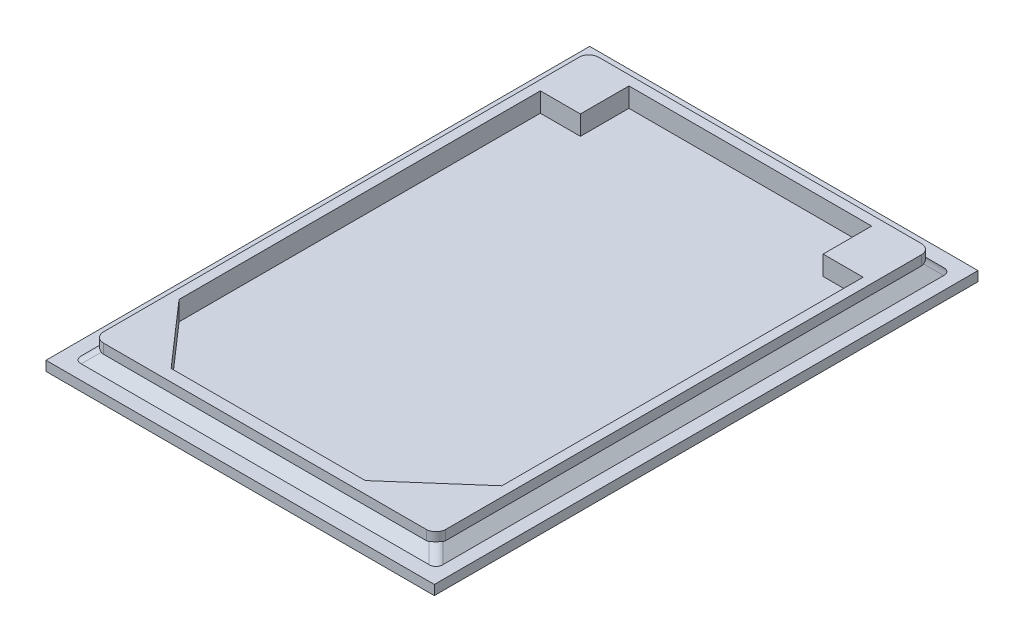
ISO-10303-21;
HEADER;
FILE_DESCRIPTION(('STEP AP214'),'2;1');
FILE_NAME('part.step','',(''),(''),'','','');
FILE_SCHEMA(('AUTOMOTIVE_DESIGN { 1 0 10303 214 1 1 1 1 }'));
ENDSEC;
DATA;
#1=APPLICATION_CONTEXT('core data for automotive mechanical design processes');
#2=APPLICATION_PROTOCOL_DEFINITION('international standard','automotive_design',2000,#1);
#3=PRODUCT_CONTEXT('',#1,'mechanical');
#4=PRODUCT('Part','Part','',(#3));
#5=PRODUCT_RELATED_PRODUCT_CATEGORY('part','',(#4));
#6=PRODUCT_DEFINITION_FORMATION('','',#4);
#7=PRODUCT_DEFINITION_CONTEXT('part definition',#1,'design');
#8=PRODUCT_DEFINITION('design','',#6,#7);
#9=PRODUCT_DEFINITION_SHAPE('','',#8);
#10=(LENGTH_UNIT() NAMED_UNIT(*) SI_UNIT(.MILLI.,.METRE.));
#11=(NAMED_UNIT(*) PLANE_ANGLE_UNIT() SI_UNIT($,.RADIAN.));
#12=(NAMED_UNIT(*) SI_UNIT($,.STERADIAN.) SOLID_ANGLE_UNIT());
#13=UNCERTAINTY_MEASURE_WITH_UNIT(LENGTH_MEASURE(1.E-05),#10,'distance_accuracy_value','');
#14=(GEOMETRIC_REPRESENTATION_CONTEXT(3) GLOBAL_UNCERTAINTY_ASSIGNED_CONTEXT((#13)) GLOBAL_UNIT_ASSIGNED_CONTEXT((#10,
#11,#12)) REPRESENTATION_CONTEXT('',''));
#15=CARTESIAN_POINT('',(0.,0.,0.));
#16=DIRECTION('',(0.,0.,1.));
#17=DIRECTION('',(1.,0.,0.));
#18=AXIS2_PLACEMENT_3D('',#15,#16,#17);
#19=CARTESIAN_POINT('',(0.,1.,0.));
#20=DIRECTION('',(0.,1.,0.));
#21=DIRECTION('',(0.,0.,1.));
#22=AXIS2_PLACEMENT_3D('',#19,#20,#21);
#23=PLANE('',#22);
#24=DIRECTION('',(0.,0.,1.));
#25=VECTOR('',#24,1.);
#26=CARTESIAN_POINT('',(23.6383511724123,1.,0.));
#27=LINE('',#26,#25);
#28=CARTESIAN_POINT('',(23.6383511724123,1.,-12.4881060797479));
#29=VERTEX_POINT('',#28);
#30=CARTESIAN_POINT('',(23.6383511724123,1.,39.097680357879));
#31=VERTEX_POINT('',#30);
#32=EDGE_CURVE('E370',#29,#31,#27,.T.);
#33=ORIENTED_EDGE('',*,*,#32,.T.);
#34=CARTESIAN_POINT('',(22.2241376100392,0.999999999999999,38.3905735766925));
#35=DIRECTION('',(0.,1.,0.));
#36=DIRECTION('',(-0.707106781186548,0.,-0.707106781186548));
#37=AXIS2_PLACEMENT_3D('',#34,#35,#36);
#38=ELLIPSE('',#37,1.73205080756886,1.);
#39=CARTESIAN_POINT('',(22.9312443912257,1.,39.8047871390655));
#40=VERTEX_POINT('',#39);
#41=EDGE_CURVE('E442',#31,#40,#38,.F.);
#42=ORIENTED_EDGE('',*,*,#41,.T.);
#43=DIRECTION('',(-1.,0.,0.));
#44=VECTOR('',#43,1.);
#45=CARTESIAN_POINT('',(0.,1.,39.8047871390655));
#46=LINE('',#45,#44);
#47=CARTESIAN_POINT('',(-12.9045420464012,1.,39.8047871390655));
#48=VERTEX_POINT('',#47);
#49=EDGE_CURVE('E367',#40,#48,#46,.T.);
#50=ORIENTED_EDGE('',*,*,#49,.T.);
#51=CARTESIAN_POINT('',(-12.1974352652146,1.,38.3905735766925));
#52=DIRECTION('',(0.,1.,0.));
#53=DIRECTION('',(0.707106781186548,0.,-0.707106781186547));
#54=AXIS2_PLACEMENT_3D('',#51,#52,#53);
#55=ELLIPSE('',#54,1.73205080756886,1.);
#56=CARTESIAN_POINT('',(-13.6116488275877,1.,39.097680357879));
#57=VERTEX_POINT('',#56);
#58=EDGE_CURVE('E449',#48,#57,#55,.F.);
#59=ORIENTED_EDGE('',*,*,#58,.T.);
#60=DIRECTION('',(0.,0.,-1.));
#61=VECTOR('',#60,1.);
#62=CARTESIAN_POINT('',(-13.6116488275877,1.,0.));
#63=LINE('',#62,#61);
#64=CARTESIAN_POINT('',(-13.6116488275877,1.,-12.4881060797479));
#65=VERTEX_POINT('',#64);
#66=EDGE_CURVE('E376',#57,#65,#63,.T.);
#67=ORIENTED_EDGE('',*,*,#66,.T.);
#68=CARTESIAN_POINT('',(-12.1974352652146,1.,-11.7809992985614));
#69=DIRECTION('',(0.,1.,0.));
#70=DIRECTION('',(-0.707106781186548,0.,-0.707106781186547));
#71=AXIS2_PLACEMENT_3D('',#68,#69,#70);
#72=ELLIPSE('',#71,1.73205080756886,1.);
#73=CARTESIAN_POINT('',(-12.9045420464012,1.,-13.1952128609345));
#74=VERTEX_POINT('',#73);
#75=EDGE_CURVE('E428',#65,#74,#72,.F.);
#76=ORIENTED_EDGE('',*,*,#75,.T.);
#77=DIRECTION('',(1.,0.,0.));
#78=VECTOR('',#77,1.);
#79=CARTESIAN_POINT('',(0.,1.,-13.1952128609345));
#80=LINE('',#79,#78);
#81=CARTESIAN_POINT('',(22.9312443912257,1.,-13.1952128609345));
#82=VERTEX_POINT('',#81);
#83=EDGE_CURVE('E373',#74,#82,#80,.T.);
#84=ORIENTED_EDGE('',*,*,#83,.T.);
#85=CARTESIAN_POINT('',(22.2241376100392,0.999999999999999,-11.7809992985614));
#86=DIRECTION('',(0.,1.,0.));
#87=DIRECTION('',(0.707106781186548,0.,-0.707106781186548));
#88=AXIS2_PLACEMENT_3D('',#85,#86,#87);
#89=ELLIPSE('',#88,1.73205080756886,1.);
#90=EDGE_CURVE('E435',#82,#29,#89,.F.);
#91=ORIENTED_EDGE('',*,*,#90,.T.);
#92=EDGE_LOOP('',(#33,#42,#50,#59,#67,#76,#84,#91));
#93=FACE_BOUND('',#92,.T.);
#94=DIRECTION('',(0.,0.,1.));
#95=VECTOR('',#94,1.);
#96=CARTESIAN_POINT('',(-15.0390033373364,1.,-14.7020848411484));
#97=LINE('',#96,#95);
#98=CARTESIAN_POINT('',(-15.0390033373364,1.,-14.7020848411484));
#99=VERTEX_POINT('',#98);
#100=CARTESIAN_POINT('',(-15.0390033373364,1.,41.2979151588516));
#101=VERTEX_POINT('',#100);
#102=EDGE_CURVE('E335',#99,#101,#97,.T.);
#103=ORIENTED_EDGE('',*,*,#102,.T.);
#104=DIRECTION('',(1.,0.,0.));
#105=VECTOR('',#104,1.);
#106=CARTESIAN_POINT('',(-15.0390033373364,1.,41.2979151588516));
#107=LINE('',#106,#105);
#108=CARTESIAN_POINT('',(24.9609966626636,1.,41.2979151588516));
#109=VERTEX_POINT('',#108);
#110=EDGE_CURVE('E338',#101,#109,#107,.T.);
#111=ORIENTED_EDGE('',*,*,#110,.T.);
#112=DIRECTION('',(0.,0.,-1.));
#113=VECTOR('',#112,1.);
#114=CARTESIAN_POINT('',(24.9609966626636,1.,-14.7020848411484));
#115=LINE('',#114,#113);
#116=CARTESIAN_POINT('',(24.9609966626636,1.,-14.7020848411484));
#117=VERTEX_POINT('',#116);
#118=EDGE_CURVE('E341',#109,#117,#115,.T.);
#119=ORIENTED_EDGE('',*,*,#118,.T.);
#120=DIRECTION('',(-1.,0.,0.));
#121=VECTOR('',#120,1.);
#122=CARTESIAN_POINT('',(-15.0390033373364,1.,-14.7020848411484));
#123=LINE('',#122,#121);
#124=EDGE_CURVE('E343',#117,#99,#123,.T.);
#125=ORIENTED_EDGE('',*,*,#124,.T.);
#126=EDGE_LOOP('',(#103,#111,#119,#125));
#127=FACE_BOUND('',#126,.T.);
#128=ADVANCED_FACE('F36',(#93,#127),#23,.T.);
#129=CARTESIAN_POINT('',(-15.0390033373364,1.,-14.7020848411484));
#130=DIRECTION('',(1.,0.,0.));
#131=DIRECTION('',(0.,0.,-1.));
#132=AXIS2_PLACEMENT_3D('',#129,#130,#131);
#133=PLANE('',#132);
#134=DIRECTION('',(0.,0.,1.));
#135=VECTOR('',#134,1.);
#136=CARTESIAN_POINT('',(-15.0390033373364,0.,-14.7020848411484));
#137=LINE('',#136,#135);
#138=CARTESIAN_POINT('',(-15.0390033373364,0.,-14.7020848411484));
#139=VERTEX_POINT('',#138);
#140=CARTESIAN_POINT('',(-15.0390033373364,0.,41.2979151588516));
#141=VERTEX_POINT('',#140);
#142=EDGE_CURVE('E334',#139,#141,#137,.T.);
#143=ORIENTED_EDGE('',*,*,#142,.T.);
#144=DIRECTION('',(0.,-1.,0.));
#145=VECTOR('',#144,1.);
#146=CARTESIAN_POINT('',(-15.0390033373364,1.,41.2979151588516));
#147=LINE('',#146,#145);
#148=EDGE_CURVE('E361',#101,#141,#147,.T.);
#149=ORIENTED_EDGE('',*,*,#148,.F.);
#150=ORIENTED_EDGE('',*,*,#102,.F.);
#151=DIRECTION('',(0.,-1.,0.));
#152=VECTOR('',#151,1.);
#153=CARTESIAN_POINT('',(-15.0390033373364,1.,-14.7020848411484));
#154=LINE('',#153,#152);
#155=EDGE_CURVE('E345',#99,#139,#154,.T.);
#156=ORIENTED_EDGE('',*,*,#155,.T.);
#157=EDGE_LOOP('',(#143,#149,#150,#156));
#158=FACE_BOUND('',#157,.T.);
#159=ADVANCED_FACE('F535',(#158),#133,.F.);
#160=CARTESIAN_POINT('',(-15.0390033373364,1.,41.2979151588516));
#161=DIRECTION('',(0.,0.,-1.));
#162=DIRECTION('',(-1.,0.,0.));
#163=AXIS2_PLACEMENT_3D('',#160,#161,#162);
#164=PLANE('',#163);
#165=DIRECTION('',(1.,0.,0.));
#166=VECTOR('',#165,1.);
#167=CARTESIAN_POINT('',(-15.0390033373364,0.,41.2979151588516));
#168=LINE('',#167,#166);
#169=CARTESIAN_POINT('',(24.9609966626636,0.,41.2979151588516));
#170=VERTEX_POINT('',#169);
#171=EDGE_CURVE('E348',#141,#170,#168,.T.);
#172=ORIENTED_EDGE('',*,*,#171,.T.);
#173=DIRECTION('',(0.,-1.,0.));
#174=VECTOR('',#173,1.);
#175=CARTESIAN_POINT('',(24.9609966626636,1.,41.2979151588516));
#176=LINE('',#175,#174);
#177=EDGE_CURVE('E358',#109,#170,#176,.T.);
#178=ORIENTED_EDGE('',*,*,#177,.F.);
#179=ORIENTED_EDGE('',*,*,#110,.F.);
#180=ORIENTED_EDGE('',*,*,#148,.T.);
#181=EDGE_LOOP('',(#172,#178,#179,#180));
#182=FACE_BOUND('',#181,.T.);
#183=ADVANCED_FACE('F541',(#182),#164,.F.);
#184=CARTESIAN_POINT('',(24.9609966626636,1.,-14.7020848411484));
#185=DIRECTION('',(-1.,0.,0.));
#186=DIRECTION('',(0.,0.,1.));
#187=AXIS2_PLACEMENT_3D('',#184,#185,#186);
#188=PLANE('',#187);
#189=DIRECTION('',(0.,0.,-1.));
#190=VECTOR('',#189,1.);
#191=CARTESIAN_POINT('',(24.9609966626636,0.,-14.7020848411484));
#192=LINE('',#191,#190);
#193=CARTESIAN_POINT('',(24.9609966626636,0.,-14.7020848411484));
#194=VERTEX_POINT('',#193);
#195=EDGE_CURVE('E350',#170,#194,#192,.T.);
#196=ORIENTED_EDGE('',*,*,#195,.T.);
#197=DIRECTION('',(0.,-1.,0.));
#198=VECTOR('',#197,1.);
#199=CARTESIAN_POINT('',(24.9609966626636,1.,-14.7020848411484));
#200=LINE('',#199,#198);
#201=EDGE_CURVE('E355',#117,#194,#200,.T.);
#202=ORIENTED_EDGE('',*,*,#201,.F.);
#203=ORIENTED_EDGE('',*,*,#118,.F.);
#204=ORIENTED_EDGE('',*,*,#177,.T.);
#205=EDGE_LOOP('',(#196,#202,#203,#204));
#206=FACE_BOUND('',#205,.T.);
#207=ADVANCED_FACE('F733',(#206),#188,.F.);
#208=CARTESIAN_POINT('',(-15.0390033373364,1.,-14.7020848411484));
#209=DIRECTION('',(0.,0.,1.));
#210=DIRECTION('',(1.,0.,0.));
#211=AXIS2_PLACEMENT_3D('',#208,#209,#210);
#212=PLANE('',#211);
#213=DIRECTION('',(-1.,0.,0.));
#214=VECTOR('',#213,1.);
#215=CARTESIAN_POINT('',(-15.0390033373364,0.,-14.7020848411484));
#216=LINE('',#215,#214);
#217=EDGE_CURVE('E339',#194,#139,#216,.T.);
#218=ORIENTED_EDGE('',*,*,#217,.T.);
#219=ORIENTED_EDGE('',*,*,#155,.F.);
#220=ORIENTED_EDGE('',*,*,#124,.F.);
#221=ORIENTED_EDGE('',*,*,#201,.T.);
#222=EDGE_LOOP('',(#218,#219,#220,#221));
#223=FACE_BOUND('',#222,.T.);
#224=ADVANCED_FACE('F725',(#223),#212,.F.);
#225=CARTESIAN_POINT('',(0.,0.,0.));
#226=DIRECTION('',(0.,1.,0.));
#227=DIRECTION('',(0.,0.,1.));
#228=AXIS2_PLACEMENT_3D('',#225,#226,#227);
#229=PLANE('',#228);
#230=ORIENTED_EDGE('',*,*,#142,.F.);
#231=ORIENTED_EDGE('',*,*,#217,.F.);
#232=ORIENTED_EDGE('',*,*,#195,.F.);
#233=ORIENTED_EDGE('',*,*,#171,.F.);
#234=EDGE_LOOP('',(#230,#231,#232,#233));
#235=FACE_BOUND('',#234,.T.);
#236=ADVANCED_FACE('F603',(#235),#229,.F.);
#237=CARTESIAN_POINT('',(0.,3.,0.));
#238=DIRECTION('',(0.,1.,0.));
#239=DIRECTION('',(0.,0.,1.));
#240=AXIS2_PLACEMENT_3D('',#237,#238,#239);
#241=PLANE('',#240);
#242=DIRECTION('',(-1.,0.,0.));
#243=VECTOR('',#242,1.);
#244=CARTESIAN_POINT('',(-12.6116488275877,3.,-12.1952128609345));
#245=LINE('',#244,#243);
#246=CARTESIAN_POINT('',(21.6383511724123,3.,-12.1952128609345));
#247=VERTEX_POINT('',#246);
#248=CARTESIAN_POINT('',(-11.6116488275877,3.,-12.1952128609345));
#249=VERTEX_POINT('',#248);
#250=EDGE_CURVE('E331',#247,#249,#245,.T.);
#251=ORIENTED_EDGE('',*,*,#250,.T.);
#252=CARTESIAN_POINT('',(-11.6116488275877,3.,-11.1952128609345));
#253=DIRECTION('',(0.,1.,0.));
#254=DIRECTION('',(0.,0.,1.));
#255=AXIS2_PLACEMENT_3D('',#252,#253,#254);
#256=CIRCLE('',#255,1.);
#257=CARTESIAN_POINT('',(-12.6116488275877,3.,-11.1952128609345));
#258=VERTEX_POINT('',#257);
#259=EDGE_CURVE('E411',#249,#258,#256,.T.);
#260=ORIENTED_EDGE('',*,*,#259,.T.);
#261=DIRECTION('',(0.,0.,1.));
#262=VECTOR('',#261,1.);
#263=CARTESIAN_POINT('',(-12.6116488275877,3.,-12.1952128609345));
#264=LINE('',#263,#262);
#265=CARTESIAN_POINT('',(-12.6116488275877,3.,37.8047871390655));
#266=VERTEX_POINT('',#265);
#267=EDGE_CURVE('E256',#258,#266,#264,.T.);
#268=ORIENTED_EDGE('',*,*,#267,.T.);
#269=CARTESIAN_POINT('',(-11.6116488275877,3.,37.8047871390655));
#270=DIRECTION('',(0.,1.,0.));
#271=DIRECTION('',(0.,0.,1.));
#272=AXIS2_PLACEMENT_3D('',#269,#270,#271);
#273=CIRCLE('',#272,1.);
#274=CARTESIAN_POINT('',(-11.6116488275877,3.,38.8047871390655));
#275=VERTEX_POINT('',#274);
#276=EDGE_CURVE('E405',#266,#275,#273,.T.);
#277=ORIENTED_EDGE('',*,*,#276,.T.);
#278=DIRECTION('',(1.,0.,0.));
#279=VECTOR('',#278,1.);
#280=CARTESIAN_POINT('',(-12.6116488275877,3.,38.8047871390655));
#281=LINE('',#280,#279);
#282=CARTESIAN_POINT('',(21.6383511724123,3.,38.8047871390655));
#283=VERTEX_POINT('',#282);
#284=EDGE_CURVE('E325',#275,#283,#281,.T.);
#285=ORIENTED_EDGE('',*,*,#284,.T.);
#286=CARTESIAN_POINT('',(21.6383511724123,3.,37.8047871390655));
#287=DIRECTION('',(0.,1.,0.));
#288=DIRECTION('',(0.,0.,1.));
#289=AXIS2_PLACEMENT_3D('',#286,#287,#288);
#290=CIRCLE('',#289,1.);
#291=CARTESIAN_POINT('',(22.6383511724123,3.,37.8047871390655));
#292=VERTEX_POINT('',#291);
#293=EDGE_CURVE('E407',#283,#292,#290,.T.);
#294=ORIENTED_EDGE('',*,*,#293,.T.);
#295=DIRECTION('',(0.,0.,-1.));
#296=VECTOR('',#295,1.);
#297=CARTESIAN_POINT('',(22.6383511724123,3.,-12.1952128609345));
#298=LINE('',#297,#296);
#299=CARTESIAN_POINT('',(22.6383511724123,3.,-11.1952128609345));
#300=VERTEX_POINT('',#299);
#301=EDGE_CURVE('E328',#292,#300,#298,.T.);
#302=ORIENTED_EDGE('',*,*,#301,.T.);
#303=CARTESIAN_POINT('',(21.6383511724123,3.,-11.1952128609345));
#304=DIRECTION('',(0.,1.,0.));
#305=DIRECTION('',(0.,0.,1.));
#306=AXIS2_PLACEMENT_3D('',#303,#304,#305);
#307=CIRCLE('',#306,1.);
#308=EDGE_CURVE('E409',#300,#247,#307,.T.);
#309=ORIENTED_EDGE('',*,*,#308,.T.);
#310=EDGE_LOOP('',(#251,#260,#268,#277,#285,#294,#302,#309));
#311=FACE_BOUND('',#310,.T.);
#312=DIRECTION('',(-1.,0.,0.));
#313=VECTOR('',#312,1.);
#314=CARTESIAN_POINT('',(-11.6116488275877,3.,-6.19521286093445));
#315=LINE('',#314,#313);
#316=CARTESIAN_POINT('',(-7.48664882758773,3.,-6.19521286093446));
#317=VERTEX_POINT('',#316);
#318=CARTESIAN_POINT('',(-11.6116488275877,3.,-6.19521286093445));
#319=VERTEX_POINT('',#318);
#320=EDGE_CURVE('E247',#317,#319,#315,.T.);
#321=ORIENTED_EDGE('',*,*,#320,.F.);
#322=DIRECTION('',(0.,0.,1.));
#323=VECTOR('',#322,1.);
#324=CARTESIAN_POINT('',(-7.48664882758773,3.,-6.19521286093446));
#325=LINE('',#324,#323);
#326=CARTESIAN_POINT('',(-7.48664882758773,3.,-11.1952128609344));
#327=VERTEX_POINT('',#326);
#328=EDGE_CURVE('E237',#327,#317,#325,.T.);
#329=ORIENTED_EDGE('',*,*,#328,.F.);
#330=DIRECTION('',(-1.,0.,0.));
#331=VECTOR('',#330,1.);
#332=CARTESIAN_POINT('',(-7.48664882758773,3.,-11.1952128609344));
#333=LINE('',#332,#331);
#334=CARTESIAN_POINT('',(17.5133511724123,3.,-11.1952128609345));
#335=VERTEX_POINT('',#334);
#336=EDGE_CURVE('E279',#335,#327,#333,.T.);
#337=ORIENTED_EDGE('',*,*,#336,.F.);
#338=DIRECTION('',(0.,0.,-1.));
#339=VECTOR('',#338,1.);
#340=CARTESIAN_POINT('',(17.5133511724123,3.,-11.1952128609345));
#341=LINE('',#340,#339);
#342=CARTESIAN_POINT('',(17.5133511724123,3.,-6.19521286093445));
#343=VERTEX_POINT('',#342);
#344=EDGE_CURVE('E276',#343,#335,#341,.T.);
#345=ORIENTED_EDGE('',*,*,#344,.F.);
#346=DIRECTION('',(-1.,0.,0.));
#347=VECTOR('',#346,1.);
#348=CARTESIAN_POINT('',(17.5133511724123,3.,-6.19521286093445));
#349=LINE('',#348,#347);
#350=CARTESIAN_POINT('',(21.6383511724123,3.,-6.19521286093445));
#351=VERTEX_POINT('',#350);
#352=EDGE_CURVE('E274',#351,#343,#349,.T.);
#353=ORIENTED_EDGE('',*,*,#352,.F.);
#354=DIRECTION('',(0.,0.,-1.));
#355=VECTOR('',#354,1.);
#356=CARTESIAN_POINT('',(21.6383511724123,3.,-6.19521286093445));
#357=LINE('',#356,#355);
#358=CARTESIAN_POINT('',(21.6383511724123,3.,31.0197871390655));
#359=VERTEX_POINT('',#358);
#360=EDGE_CURVE('E272',#359,#351,#357,.T.);
#361=ORIENTED_EDGE('',*,*,#360,.F.);
#362=DIRECTION('',(0.752354793863279,0.,-0.658758122645135));
#363=VECTOR('',#362,1.);
#364=CARTESIAN_POINT('',(21.6383511724123,3.,31.0197871390655));
#365=LINE('',#364,#363);
#366=CARTESIAN_POINT('',(14.1383511724123,3.,37.5867499073474));
#367=VERTEX_POINT('',#366);
#368=EDGE_CURVE('E270',#367,#359,#365,.T.);
#369=ORIENTED_EDGE('',*,*,#368,.F.);
#370=DIRECTION('',(1.,0.,0.));
#371=VECTOR('',#370,1.);
#372=CARTESIAN_POINT('',(14.1383511724123,3.,37.5867499073474));
#373=LINE('',#372,#371);
#374=CARTESIAN_POINT('',(-5.86164882758774,3.,37.5867499073474));
#375=VERTEX_POINT('',#374);
#376=EDGE_CURVE('E268',#375,#367,#373,.T.);
#377=ORIENTED_EDGE('',*,*,#376,.F.);
#378=DIRECTION('',(0.658758122645136,0.,0.752354793863279));
#379=VECTOR('',#378,1.);
#380=CARTESIAN_POINT('',(-5.86164882758774,3.,37.5867499073474));
#381=LINE('',#380,#379);
#382=CARTESIAN_POINT('',(-11.6116488275877,3.,31.0197871390656));
#383=VERTEX_POINT('',#382);
#384=EDGE_CURVE('E264',#383,#375,#381,.T.);
#385=ORIENTED_EDGE('',*,*,#384,.F.);
#386=DIRECTION('',(0.,0.,1.));
#387=VECTOR('',#386,1.);
#388=CARTESIAN_POINT('',(-11.6116488275877,3.,31.0197871390656));
#389=LINE('',#388,#387);
#390=EDGE_CURVE('E262',#319,#383,#389,.T.);
#391=ORIENTED_EDGE('',*,*,#390,.F.);
#392=EDGE_LOOP('',(#321,#329,#337,#345,#353,#361,#369,#377,#385,#391));
#393=FACE_BOUND('',#392,.T.);
#394=ADVANCED_FACE('F260',(#311,#393),#241,.T.);
#395=CARTESIAN_POINT('',(-12.6116488275877,3.,-12.1952128609345));
#396=DIRECTION('',(1.,0.,0.));
#397=DIRECTION('',(0.,0.,-1.));
#398=AXIS2_PLACEMENT_3D('',#395,#396,#397);
#399=PLANE('',#398);
#400=ORIENTED_EDGE('',*,*,#267,.F.);
#401=DIRECTION('',(0.,-1.,0.));
#402=VECTOR('',#401,1.);
#403=CARTESIAN_POINT('',(-12.6116488275877,3.,-11.1952128609345));
#404=LINE('',#403,#402);
#405=CARTESIAN_POINT('',(-12.6116488275877,2.00000000000001,-11.1952128609345));
#406=VERTEX_POINT('',#405);
#407=EDGE_CURVE('E399',#258,#406,#404,.T.);
#408=ORIENTED_EDGE('',*,*,#407,.T.);
#409=DIRECTION('',(0.,0.,1.));
#410=VECTOR('',#409,1.);
#411=CARTESIAN_POINT('',(-12.6116488275877,2.00000000000001,-12.1952128609345));
#412=LINE('',#411,#410);
#413=CARTESIAN_POINT('',(-12.6116488275877,2.00000000000001,37.8047871390655));
#414=VERTEX_POINT('',#413);
#415=EDGE_CURVE('E364',#406,#414,#412,.T.);
#416=ORIENTED_EDGE('',*,*,#415,.T.);
#417=DIRECTION('',(0.,-1.,0.));
#418=VECTOR('',#417,1.);
#419=CARTESIAN_POINT('',(-12.6116488275877,3.,37.8047871390655));
#420=LINE('',#419,#418);
#421=EDGE_CURVE('E397',#414,#266,#420,.F.);
#422=ORIENTED_EDGE('',*,*,#421,.T.);
#423=EDGE_LOOP('',(#400,#408,#416,#422));
#424=FACE_BOUND('',#423,.T.);
#425=ADVANCED_FACE('F473',(#424),#399,.F.);
#426=CARTESIAN_POINT('',(-12.6116488275877,3.,38.8047871390655));
#427=DIRECTION('',(0.,0.,-1.));
#428=DIRECTION('',(-1.,0.,0.));
#429=AXIS2_PLACEMENT_3D('',#426,#427,#428);
#430=PLANE('',#429);
#431=DIRECTION('',(1.,0.,0.));
#432=VECTOR('',#431,1.);
#433=CARTESIAN_POINT('',(-12.6116488275877,2.00000000000001,38.8047871390655));
#434=LINE('',#433,#432);
#435=CARTESIAN_POINT('',(-11.6116488275877,2.00000000000001,38.8047871390655));
#436=VERTEX_POINT('',#435);
#437=CARTESIAN_POINT('',(21.6383511724123,2.00000000000001,38.8047871390655));
#438=VERTEX_POINT('',#437);
#439=EDGE_CURVE('E385',#436,#438,#434,.T.);
#440=ORIENTED_EDGE('',*,*,#439,.T.);
#441=DIRECTION('',(0.,-1.,0.));
#442=VECTOR('',#441,1.);
#443=CARTESIAN_POINT('',(21.6383511724123,3.,38.8047871390655));
#444=LINE('',#443,#442);
#445=EDGE_CURVE('E426',#438,#283,#444,.F.);
#446=ORIENTED_EDGE('',*,*,#445,.T.);
#447=ORIENTED_EDGE('',*,*,#284,.F.);
#448=DIRECTION('',(0.,-1.,0.));
#449=VECTOR('',#448,1.);
#450=CARTESIAN_POINT('',(-11.6116488275877,3.,38.8047871390655));
#451=LINE('',#450,#449);
#452=EDGE_CURVE('E424',#275,#436,#451,.T.);
#453=ORIENTED_EDGE('',*,*,#452,.T.);
#454=EDGE_LOOP('',(#440,#446,#447,#453));
#455=FACE_BOUND('',#454,.T.);
#456=ADVANCED_FACE('F503',(#455),#430,.F.);
#457=CARTESIAN_POINT('',(22.6383511724123,3.,-12.1952128609345));
#458=DIRECTION('',(-1.,0.,0.));
#459=DIRECTION('',(0.,0.,1.));
#460=AXIS2_PLACEMENT_3D('',#457,#458,#459);
#461=PLANE('',#460);
#462=DIRECTION('',(0.,0.,-1.));
#463=VECTOR('',#462,1.);
#464=CARTESIAN_POINT('',(22.6383511724123,2.00000000000001,-12.1952128609345));
#465=LINE('',#464,#463);
#466=CARTESIAN_POINT('',(22.6383511724123,2.00000000000001,37.8047871390655));
#467=VERTEX_POINT('',#466);
#468=CARTESIAN_POINT('',(22.6383511724123,2.00000000000001,-11.1952128609345));
#469=VERTEX_POINT('',#468);
#470=EDGE_CURVE('E382',#467,#469,#465,.T.);
#471=ORIENTED_EDGE('',*,*,#470,.T.);
#472=DIRECTION('',(0.,-1.,0.));
#473=VECTOR('',#472,1.);
#474=CARTESIAN_POINT('',(22.6383511724123,3.,-11.1952128609345));
#475=LINE('',#474,#473);
#476=EDGE_CURVE('E419',#469,#300,#475,.F.);
#477=ORIENTED_EDGE('',*,*,#476,.T.);
#478=ORIENTED_EDGE('',*,*,#301,.F.);
#479=DIRECTION('',(0.,-1.,0.));
#480=VECTOR('',#479,1.);
#481=CARTESIAN_POINT('',(22.6383511724123,3.,37.8047871390655));
#482=LINE('',#481,#480);
#483=EDGE_CURVE('E417',#292,#467,#482,.T.);
#484=ORIENTED_EDGE('',*,*,#483,.T.);
#485=EDGE_LOOP('',(#471,#477,#478,#484));
#486=FACE_BOUND('',#485,.T.);
#487=ADVANCED_FACE('F606',(#486),#461,.F.);
#488=CARTESIAN_POINT('',(-12.6116488275877,3.,-12.1952128609345));
#489=DIRECTION('',(0.,0.,1.));
#490=DIRECTION('',(1.,0.,0.));
#491=AXIS2_PLACEMENT_3D('',#488,#489,#490);
#492=PLANE('',#491);
#493=DIRECTION('',(-1.,0.,0.));
#494=VECTOR('',#493,1.);
#495=CARTESIAN_POINT('',(-12.6116488275877,2.00000000000001,-12.1952128609345));
#496=LINE('',#495,#494);
#497=CARTESIAN_POINT('',(21.6383511724123,2.00000000000001,-12.1952128609345));
#498=VERTEX_POINT('',#497);
#499=CARTESIAN_POINT('',(-11.6116488275877,2.00000000000001,-12.1952128609345));
#500=VERTEX_POINT('',#499);
#501=EDGE_CURVE('E379',#498,#500,#496,.T.);
#502=ORIENTED_EDGE('',*,*,#501,.T.);
#503=DIRECTION('',(0.,-1.,0.));
#504=VECTOR('',#503,1.);
#505=CARTESIAN_POINT('',(-11.6116488275877,3.,-12.1952128609345));
#506=LINE('',#505,#504);
#507=EDGE_CURVE('E403',#500,#249,#506,.F.);
#508=ORIENTED_EDGE('',*,*,#507,.T.);
#509=ORIENTED_EDGE('',*,*,#250,.F.);
#510=DIRECTION('',(0.,-1.,0.));
#511=VECTOR('',#510,1.);
#512=CARTESIAN_POINT('',(21.6383511724123,3.,-12.1952128609345));
#513=LINE('',#512,#511);
#514=EDGE_CURVE('E401',#247,#498,#513,.T.);
#515=ORIENTED_EDGE('',*,*,#514,.T.);
#516=EDGE_LOOP('',(#502,#508,#509,#515));
#517=FACE_BOUND('',#516,.T.);
#518=ADVANCED_FACE('F510',(#517),#492,.F.);
#519=CARTESIAN_POINT('',(-7.48664882758773,3.,-6.19521286093446));
#520=DIRECTION('',(1.,0.,0.));
#521=DIRECTION('',(0.,0.,-1.));
#522=AXIS2_PLACEMENT_3D('',#519,#520,#521);
#523=PLANE('',#522);
#524=DIRECTION('',(0.,0.,1.));
#525=VECTOR('',#524,1.);
#526=CARTESIAN_POINT('',(-7.48664882758773,1.,-6.19521286093446));
#527=LINE('',#526,#525);
#528=CARTESIAN_POINT('',(-7.48664882758773,1.,-11.1952128609344));
#529=VERTEX_POINT('',#528);
#530=CARTESIAN_POINT('',(-7.48664882758773,1.,-6.19521286093446));
#531=VERTEX_POINT('',#530);
#532=EDGE_CURVE('E281',#529,#531,#527,.T.);
#533=ORIENTED_EDGE('',*,*,#532,.F.);
#534=DIRECTION('',(0.,-1.,0.));
#535=VECTOR('',#534,1.);
#536=CARTESIAN_POINT('',(-7.48664882758773,3.,-11.1952128609344));
#537=LINE('',#536,#535);
#538=EDGE_CURVE('E243',#327,#529,#537,.T.);
#539=ORIENTED_EDGE('',*,*,#538,.F.);
#540=ORIENTED_EDGE('',*,*,#328,.T.);
#541=DIRECTION('',(0.,-1.,0.));
#542=VECTOR('',#541,1.);
#543=CARTESIAN_POINT('',(-7.48664882758773,3.,-6.19521286093446));
#544=LINE('',#543,#542);
#545=EDGE_CURVE('E241',#317,#531,#544,.T.);
#546=ORIENTED_EDGE('',*,*,#545,.T.);
#547=EDGE_LOOP('',(#533,#539,#540,#546));
#548=FACE_BOUND('',#547,.T.);
#549=ADVANCED_FACE('F240',(#548),#523,.T.);
#550=CARTESIAN_POINT('',(-11.6116488275877,3.,-6.19521286093445));
#551=DIRECTION('',(0.,0.,1.));
#552=DIRECTION('',(1.,0.,0.));
#553=AXIS2_PLACEMENT_3D('',#550,#551,#552);
#554=PLANE('',#553);
#555=DIRECTION('',(-1.,0.,0.));
#556=VECTOR('',#555,1.);
#557=CARTESIAN_POINT('',(-11.6116488275877,1.,-6.19521286093445));
#558=LINE('',#557,#556);
#559=CARTESIAN_POINT('',(-11.6116488275877,1.,-6.19521286093445));
#560=VERTEX_POINT('',#559);
#561=EDGE_CURVE('E255',#531,#560,#558,.T.);
#562=ORIENTED_EDGE('',*,*,#561,.F.);
#563=ORIENTED_EDGE('',*,*,#545,.F.);
#564=ORIENTED_EDGE('',*,*,#320,.T.);
#565=DIRECTION('',(0.,-1.,0.));
#566=VECTOR('',#565,1.);
#567=CARTESIAN_POINT('',(-11.6116488275877,3.,-6.19521286093445));
#568=LINE('',#567,#566);
#569=EDGE_CURVE('E257',#319,#560,#568,.T.);
#570=ORIENTED_EDGE('',*,*,#569,.T.);
#571=EDGE_LOOP('',(#562,#563,#564,#570));
#572=FACE_BOUND('',#571,.T.);
#573=ADVANCED_FACE('F252',(#572),#554,.T.);
#574=CARTESIAN_POINT('',(-11.6116488275877,3.,31.0197871390656));
#575=DIRECTION('',(1.,0.,0.));
#576=DIRECTION('',(0.,0.,-1.));
#577=AXIS2_PLACEMENT_3D('',#574,#575,#576);
#578=PLANE('',#577);
#579=DIRECTION('',(0.,0.,1.));
#580=VECTOR('',#579,1.);
#581=CARTESIAN_POINT('',(-11.6116488275877,1.,31.0197871390656));
#582=LINE('',#581,#580);
#583=CARTESIAN_POINT('',(-11.6116488275877,1.,31.0197871390656));
#584=VERTEX_POINT('',#583);
#585=EDGE_CURVE('E285',#560,#584,#582,.T.);
#586=ORIENTED_EDGE('',*,*,#585,.F.);
#587=ORIENTED_EDGE('',*,*,#569,.F.);
#588=ORIENTED_EDGE('',*,*,#390,.T.);
#589=DIRECTION('',(0.,-1.,0.));
#590=VECTOR('',#589,1.);
#591=CARTESIAN_POINT('',(-11.6116488275877,3.,31.0197871390656));
#592=LINE('',#591,#590);
#593=EDGE_CURVE('E319',#383,#584,#592,.T.);
#594=ORIENTED_EDGE('',*,*,#593,.T.);
#595=EDGE_LOOP('',(#586,#587,#588,#594));
#596=FACE_BOUND('',#595,.T.);
#597=ADVANCED_FACE('F588',(#596),#578,.T.);
#598=CARTESIAN_POINT('',(-5.86164882758774,3.,37.5867499073474));
#599=DIRECTION('',(0.752354793863279,0.,-0.658758122645136));
#600=DIRECTION('',(-0.658758122645136,0.,-0.752354793863279));
#601=AXIS2_PLACEMENT_3D('',#598,#599,#600);
#602=PLANE('',#601);
#603=DIRECTION('',(0.658758122645136,0.,0.752354793863279));
#604=VECTOR('',#603,1.);
#605=CARTESIAN_POINT('',(-5.86164882758774,1.,37.5867499073474));
#606=LINE('',#605,#604);
#607=CARTESIAN_POINT('',(-5.86164882758774,1.,37.5867499073474));
#608=VERTEX_POINT('',#607);
#609=EDGE_CURVE('E287',#584,#608,#606,.T.);
#610=ORIENTED_EDGE('',*,*,#609,.F.);
#611=ORIENTED_EDGE('',*,*,#593,.F.);
#612=ORIENTED_EDGE('',*,*,#384,.T.);
#613=DIRECTION('',(0.,-1.,0.));
#614=VECTOR('',#613,1.);
#615=CARTESIAN_POINT('',(-5.86164882758774,3.,37.5867499073474));
#616=LINE('',#615,#614);
#617=EDGE_CURVE('E316',#375,#608,#616,.T.);
#618=ORIENTED_EDGE('',*,*,#617,.T.);
#619=EDGE_LOOP('',(#610,#611,#612,#618));
#620=FACE_BOUND('',#619,.T.);
#621=ADVANCED_FACE('F584',(#620),#602,.T.);
#622=CARTESIAN_POINT('',(14.1383511724123,3.,37.5867499073474));
#623=DIRECTION('',(0.,0.,-1.));
#624=DIRECTION('',(-1.,0.,0.));
#625=AXIS2_PLACEMENT_3D('',#622,#623,#624);
#626=PLANE('',#625);
#627=DIRECTION('',(1.,0.,0.));
#628=VECTOR('',#627,1.);
#629=CARTESIAN_POINT('',(14.1383511724123,1.,37.5867499073474));
#630=LINE('',#629,#628);
#631=CARTESIAN_POINT('',(14.1383511724123,1.,37.5867499073474));
#632=VERTEX_POINT('',#631);
#633=EDGE_CURVE('E289',#608,#632,#630,.T.);
#634=ORIENTED_EDGE('',*,*,#633,.F.);
#635=ORIENTED_EDGE('',*,*,#617,.F.);
#636=ORIENTED_EDGE('',*,*,#376,.T.);
#637=DIRECTION('',(0.,-1.,0.));
#638=VECTOR('',#637,1.);
#639=CARTESIAN_POINT('',(14.1383511724123,3.,37.5867499073474));
#640=LINE('',#639,#638);
#641=EDGE_CURVE('E313',#367,#632,#640,.T.);
#642=ORIENTED_EDGE('',*,*,#641,.T.);
#643=EDGE_LOOP('',(#634,#635,#636,#642));
#644=FACE_BOUND('',#643,.T.);
#645=ADVANCED_FACE('F580',(#644),#626,.T.);
#646=CARTESIAN_POINT('',(21.6383511724123,3.,31.0197871390655));
#647=DIRECTION('',(-0.658758122645135,0.,-0.752354793863279));
#648=DIRECTION('',(-0.752354793863279,0.,0.658758122645135));
#649=AXIS2_PLACEMENT_3D('',#646,#647,#648);
#650=PLANE('',#649);
#651=DIRECTION('',(0.752354793863279,0.,-0.658758122645135));
#652=VECTOR('',#651,1.);
#653=CARTESIAN_POINT('',(21.6383511724123,1.,31.0197871390655));
#654=LINE('',#653,#652);
#655=CARTESIAN_POINT('',(21.6383511724123,1.,31.0197871390655));
#656=VERTEX_POINT('',#655);
#657=EDGE_CURVE('E291',#632,#656,#654,.T.);
#658=ORIENTED_EDGE('',*,*,#657,.F.);
#659=ORIENTED_EDGE('',*,*,#641,.F.);
#660=ORIENTED_EDGE('',*,*,#368,.T.);
#661=DIRECTION('',(0.,-1.,0.));
#662=VECTOR('',#661,1.);
#663=CARTESIAN_POINT('',(21.6383511724123,3.,31.0197871390655));
#664=LINE('',#663,#662);
#665=EDGE_CURVE('E310',#359,#656,#664,.T.);
#666=ORIENTED_EDGE('',*,*,#665,.T.);
#667=EDGE_LOOP('',(#658,#659,#660,#666));
#668=FACE_BOUND('',#667,.T.);
#669=ADVANCED_FACE('F577',(#668),#650,.T.);
#670=CARTESIAN_POINT('',(21.6383511724123,3.,-6.19521286093445));
#671=DIRECTION('',(-1.,0.,0.));
#672=DIRECTION('',(0.,0.,1.));
#673=AXIS2_PLACEMENT_3D('',#670,#671,#672);
#674=PLANE('',#673);
#675=DIRECTION('',(0.,0.,-1.));
#676=VECTOR('',#675,1.);
#677=CARTESIAN_POINT('',(21.6383511724123,1.,-6.19521286093445));
#678=LINE('',#677,#676);
#679=CARTESIAN_POINT('',(21.6383511724123,1.,-6.19521286093445));
#680=VERTEX_POINT('',#679);
#681=EDGE_CURVE('E293',#656,#680,#678,.T.);
#682=ORIENTED_EDGE('',*,*,#681,.F.);
#683=ORIENTED_EDGE('',*,*,#665,.F.);
#684=ORIENTED_EDGE('',*,*,#360,.T.);
#685=DIRECTION('',(0.,-1.,0.));
#686=VECTOR('',#685,1.);
#687=CARTESIAN_POINT('',(21.6383511724123,3.,-6.19521286093445));
#688=LINE('',#687,#686);
#689=EDGE_CURVE('E307',#351,#680,#688,.T.);
#690=ORIENTED_EDGE('',*,*,#689,.T.);
#691=EDGE_LOOP('',(#682,#683,#684,#690));
#692=FACE_BOUND('',#691,.T.);
#693=ADVANCED_FACE('F570',(#692),#674,.T.);
#694=CARTESIAN_POINT('',(17.5133511724123,3.,-6.19521286093445));
#695=DIRECTION('',(0.,0.,1.));
#696=DIRECTION('',(1.,0.,0.));
#697=AXIS2_PLACEMENT_3D('',#694,#695,#696);
#698=PLANE('',#697);
#699=DIRECTION('',(-1.,0.,0.));
#700=VECTOR('',#699,1.);
#701=CARTESIAN_POINT('',(17.5133511724123,1.,-6.19521286093445));
#702=LINE('',#701,#700);
#703=CARTESIAN_POINT('',(17.5133511724123,1.,-6.19521286093445));
#704=VERTEX_POINT('',#703);
#705=EDGE_CURVE('E295',#680,#704,#702,.T.);
#706=ORIENTED_EDGE('',*,*,#705,.F.);
#707=ORIENTED_EDGE('',*,*,#689,.F.);
#708=ORIENTED_EDGE('',*,*,#352,.T.);
#709=DIRECTION('',(0.,-1.,0.));
#710=VECTOR('',#709,1.);
#711=CARTESIAN_POINT('',(17.5133511724123,3.,-6.19521286093445));
#712=LINE('',#711,#710);
#713=EDGE_CURVE('E304',#343,#704,#712,.T.);
#714=ORIENTED_EDGE('',*,*,#713,.T.);
#715=EDGE_LOOP('',(#706,#707,#708,#714));
#716=FACE_BOUND('',#715,.T.);
#717=ADVANCED_FACE('F566',(#716),#698,.T.);
#718=CARTESIAN_POINT('',(17.5133511724123,3.,-11.1952128609345));
#719=DIRECTION('',(-1.,0.,0.));
#720=DIRECTION('',(0.,0.,1.));
#721=AXIS2_PLACEMENT_3D('',#718,#719,#720);
#722=PLANE('',#721);
#723=DIRECTION('',(0.,0.,-1.));
#724=VECTOR('',#723,1.);
#725=CARTESIAN_POINT('',(17.5133511724123,1.,-11.1952128609345));
#726=LINE('',#725,#724);
#727=CARTESIAN_POINT('',(17.5133511724123,1.,-11.1952128609345));
#728=VERTEX_POINT('',#727);
#729=EDGE_CURVE('E297',#704,#728,#726,.T.);
#730=ORIENTED_EDGE('',*,*,#729,.F.);
#731=ORIENTED_EDGE('',*,*,#713,.F.);
#732=ORIENTED_EDGE('',*,*,#344,.T.);
#733=DIRECTION('',(0.,-1.,0.));
#734=VECTOR('',#733,1.);
#735=CARTESIAN_POINT('',(17.5133511724123,3.,-11.1952128609345));
#736=LINE('',#735,#734);
#737=EDGE_CURVE('E301',#335,#728,#736,.T.);
#738=ORIENTED_EDGE('',*,*,#737,.T.);
#739=EDGE_LOOP('',(#730,#731,#732,#738));
#740=FACE_BOUND('',#739,.T.);
#741=ADVANCED_FACE('F554',(#740),#722,.T.);
#742=CARTESIAN_POINT('',(-7.48664882758773,3.,-11.1952128609344));
#743=DIRECTION('',(0.,0.,1.));
#744=DIRECTION('',(1.,0.,0.));
#745=AXIS2_PLACEMENT_3D('',#742,#743,#744);
#746=PLANE('',#745);
#747=DIRECTION('',(-1.,0.,0.));
#748=VECTOR('',#747,1.);
#749=CARTESIAN_POINT('',(-7.48664882758773,1.,-11.1952128609344));
#750=LINE('',#749,#748);
#751=EDGE_CURVE('E248',#728,#529,#750,.T.);
#752=ORIENTED_EDGE('',*,*,#751,.F.);
#753=ORIENTED_EDGE('',*,*,#737,.F.);
#754=ORIENTED_EDGE('',*,*,#336,.T.);
#755=ORIENTED_EDGE('',*,*,#538,.T.);
#756=EDGE_LOOP('',(#752,#753,#754,#755));
#757=FACE_BOUND('',#756,.T.);
#758=ADVANCED_FACE('F547',(#757),#746,.T.);
#759=ORIENTED_EDGE('',*,*,#532,.T.);
#760=ORIENTED_EDGE('',*,*,#561,.T.);
#761=ORIENTED_EDGE('',*,*,#585,.T.);
#762=ORIENTED_EDGE('',*,*,#609,.T.);
#763=ORIENTED_EDGE('',*,*,#633,.T.);
#764=ORIENTED_EDGE('',*,*,#657,.T.);
#765=ORIENTED_EDGE('',*,*,#681,.T.);
#766=ORIENTED_EDGE('',*,*,#705,.T.);
#767=ORIENTED_EDGE('',*,*,#729,.T.);
#768=ORIENTED_EDGE('',*,*,#751,.T.);
#769=EDGE_LOOP('',(#759,#760,#761,#762,#763,#764,#765,#766,#767,#768));
#770=FACE_BOUND('',#769,.T.);
#771=ADVANCED_FACE('F537',(#770),#23,.T.);
#772=CARTESIAN_POINT('',(22.6383511724123,2.00000000000001,-12.1952128609345));
#773=DIRECTION('',(-0.707106781186552,-0.707106781186542,0.));
#774=DIRECTION('',(0.,0.,-1.));
#775=AXIS2_PLACEMENT_3D('',#772,#773,#774);
#776=PLANE('',#775);
#777=ORIENTED_EDGE('',*,*,#32,.F.);
#778=DIRECTION('',(0.577350269189623,-0.577350269189631,-0.577350269189623));
#779=VECTOR('',#778,1.);
#780=CARTESIAN_POINT('',(22.8740534328078,1.7642977396045,-11.7238083401434));
#781=LINE('',#780,#779);
#782=CARTESIAN_POINT('',(22.6042769987013,2.03407417371095,-11.454031906037));
#783=VERTEX_POINT('',#782);
#784=EDGE_CURVE('E415',#29,#783,#781,.F.);
#785=ORIENTED_EDGE('',*,*,#784,.T.);
#786=CARTESIAN_POINT('',(21.6383511724123,3.00000000000003,-11.1952128609345));
#787=DIRECTION('',(-0.707106781186552,-0.707106781186542,0.));
#788=DIRECTION('',(0.707106781186543,-0.707106781186552,0.));
#789=AXIS2_PLACEMENT_3D('',#786,#787,#788);
#790=ELLIPSE('',#789,1.41421356237311,1.);
#791=EDGE_CURVE('E440',#783,#469,#790,.T.);
#792=ORIENTED_EDGE('',*,*,#791,.T.);
#793=ORIENTED_EDGE('',*,*,#470,.F.);
#794=CARTESIAN_POINT('',(21.6383511724123,3.00000000000003,37.8047871390655));
#795=DIRECTION('',(-0.707106781186552,-0.707106781186542,0.));
#796=DIRECTION('',(0.707106781186543,-0.707106781186552,0.));
#797=AXIS2_PLACEMENT_3D('',#794,#795,#796);
#798=ELLIPSE('',#797,1.41421356237311,1.);
#799=CARTESIAN_POINT('',(22.6042769987013,2.03407417371095,38.0636061841681));
#800=VERTEX_POINT('',#799);
#801=EDGE_CURVE('E444',#467,#800,#798,.T.);
#802=ORIENTED_EDGE('',*,*,#801,.T.);
#803=DIRECTION('',(-0.577350269189623,0.577350269189631,-0.577350269189623));
#804=VECTOR('',#803,1.);
#805=CARTESIAN_POINT('',(5.87405343280794,18.7642977396046,21.3333826182747));
#806=LINE('',#805,#804);
#807=EDGE_CURVE('E413',#800,#31,#806,.F.);
#808=ORIENTED_EDGE('',*,*,#807,.T.);
#809=EDGE_LOOP('',(#777,#785,#792,#793,#802,#808));
#810=FACE_BOUND('',#809,.T.);
#811=ADVANCED_FACE('F495',(#810),#776,.F.);
#812=CARTESIAN_POINT('',(-12.6116488275877,2.00000000000001,-12.1952128609345));
#813=DIRECTION('',(0.,-0.707106781186542,0.707106781186552));
#814=DIRECTION('',(-1.,0.,0.));
#815=AXIS2_PLACEMENT_3D('',#812,#813,#814);
#816=PLANE('',#815);
#817=ORIENTED_EDGE('',*,*,#83,.F.);
#818=DIRECTION('',(-0.577350269189623,-0.577350269189631,-0.577350269189623));
#819=VECTOR('',#818,1.);
#820=CARTESIAN_POINT('',(-12.1402443067967,1.7642977396045,-12.43091512133));
#821=LINE('',#820,#819);
#822=CARTESIAN_POINT('',(-11.8704678726902,2.03407417371095,-12.1611386872235));
#823=VERTEX_POINT('',#822);
#824=EDGE_CURVE('E395',#74,#823,#821,.F.);
#825=ORIENTED_EDGE('',*,*,#824,.T.);
#826=CARTESIAN_POINT('',(-11.6116488275877,3.00000000000003,-11.1952128609345));
#827=DIRECTION('',(0.,-0.707106781186542,0.707106781186552));
#828=DIRECTION('',(0.,-0.707106781186552,-0.707106781186543));
#829=AXIS2_PLACEMENT_3D('',#826,#827,#828);
#830=ELLIPSE('',#829,1.41421356237311,1.);
#831=EDGE_CURVE('E433',#823,#500,#830,.T.);
#832=ORIENTED_EDGE('',*,*,#831,.T.);
#833=ORIENTED_EDGE('',*,*,#501,.F.);
#834=CARTESIAN_POINT('',(21.6383511724123,3.00000000000003,-11.1952128609345));
#835=DIRECTION('',(0.,-0.707106781186542,0.707106781186552));
#836=DIRECTION('',(0.,-0.707106781186552,-0.707106781186543));
#837=AXIS2_PLACEMENT_3D('',#834,#835,#836);
#838=ELLIPSE('',#837,1.41421356237311,1.);
#839=CARTESIAN_POINT('',(21.8971702175148,2.03407417371095,-12.1611386872235));
#840=VERTEX_POINT('',#839);
#841=EDGE_CURVE('E437',#498,#840,#838,.T.);
#842=ORIENTED_EDGE('',*,*,#841,.T.);
#843=DIRECTION('',(0.577350269189623,-0.577350269189631,-0.577350269189623));
#844=VECTOR('',#843,1.);
#845=CARTESIAN_POINT('',(10.4169466516213,13.5142977396045,-0.680915121330079));
#846=LINE('',#845,#844);
#847=EDGE_CURVE('E392',#840,#82,#846,.T.);
#848=ORIENTED_EDGE('',*,*,#847,.T.);
#849=EDGE_LOOP('',(#817,#825,#832,#833,#842,#848));
#850=FACE_BOUND('',#849,.T.);
#851=ADVANCED_FACE('F519',(#850),#816,.F.);
#852=CARTESIAN_POINT('',(-12.6116488275877,2.00000000000001,38.8047871390655));
#853=DIRECTION('',(0.,-0.707106781186542,-0.707106781186552));
#854=DIRECTION('',(1.,0.,0.));
#855=AXIS2_PLACEMENT_3D('',#852,#853,#854);
#856=PLANE('',#855);
#857=ORIENTED_EDGE('',*,*,#49,.F.);
#858=DIRECTION('',(-0.577350269189623,0.577350269189631,-0.577350269189623));
#859=VECTOR('',#858,1.);
#860=CARTESIAN_POINT('',(10.4169466516213,13.5142977396046,27.2904893994612));
#861=LINE('',#860,#859);
#862=CARTESIAN_POINT('',(21.8971702175148,2.03407417371095,38.7707129653546));
#863=VERTEX_POINT('',#862);
#864=EDGE_CURVE('E422',#40,#863,#861,.T.);
#865=ORIENTED_EDGE('',*,*,#864,.T.);
#866=CARTESIAN_POINT('',(21.6383511724123,3.00000000000003,37.8047871390655));
#867=DIRECTION('',(0.,-0.707106781186542,-0.707106781186552));
#868=DIRECTION('',(0.,-0.707106781186552,0.707106781186543));
#869=AXIS2_PLACEMENT_3D('',#866,#867,#868);
#870=ELLIPSE('',#869,1.41421356237311,1.);
#871=EDGE_CURVE('E447',#863,#438,#870,.T.);
#872=ORIENTED_EDGE('',*,*,#871,.T.);
#873=ORIENTED_EDGE('',*,*,#439,.F.);
#874=CARTESIAN_POINT('',(-11.6116488275877,3.00000000000003,37.8047871390655));
#875=DIRECTION('',(0.,-0.707106781186542,-0.707106781186552));
#876=DIRECTION('',(0.,-0.707106781186552,0.707106781186543));
#877=AXIS2_PLACEMENT_3D('',#874,#875,#876);
#878=ELLIPSE('',#877,1.41421356237311,1.);
#879=CARTESIAN_POINT('',(-11.8704678726902,2.03407417371095,38.7707129653546));
#880=VERTEX_POINT('',#879);
#881=EDGE_CURVE('E45',#436,#880,#878,.T.);
#882=ORIENTED_EDGE('',*,*,#881,.T.);
#883=DIRECTION('',(0.577350269189623,0.577350269189631,-0.577350269189623));
#884=VECTOR('',#883,1.);
#885=CARTESIAN_POINT('',(-12.1402443067967,1.7642977396045,39.0404893994611));
#886=LINE('',#885,#884);
#887=EDGE_CURVE('E53',#880,#48,#886,.F.);
#888=ORIENTED_EDGE('',*,*,#887,.T.);
#889=EDGE_LOOP('',(#857,#865,#872,#873,#882,#888));
#890=FACE_BOUND('',#889,.T.);
#891=ADVANCED_FACE('F488',(#890),#856,.F.);
#892=CARTESIAN_POINT('',(-12.6116488275877,2.00000000000001,-12.1952128609345));
#893=DIRECTION('',(0.707106781186552,-0.707106781186543,0.));
#894=DIRECTION('',(0.,0.,1.));
#895=AXIS2_PLACEMENT_3D('',#892,#893,#894);
#896=PLANE('',#895);
#897=ORIENTED_EDGE('',*,*,#415,.F.);
#898=CARTESIAN_POINT('',(-11.6116488275877,3.00000000000003,-11.1952128609345));
#899=DIRECTION('',(0.707106781186552,-0.707106781186543,0.));
#900=DIRECTION('',(-0.707106781186543,-0.707106781186552,0.));
#901=AXIS2_PLACEMENT_3D('',#898,#899,#900);
#902=ELLIPSE('',#901,1.4142135623731,1.);
#903=CARTESIAN_POINT('',(-12.5775746538768,2.03407417371095,-11.454031906037));
#904=VERTEX_POINT('',#903);
#905=EDGE_CURVE('E430',#406,#904,#902,.T.);
#906=ORIENTED_EDGE('',*,*,#905,.T.);
#907=DIRECTION('',(-0.577350269189623,-0.577350269189631,-0.577350269189623));
#908=VECTOR('',#907,1.);
#909=CARTESIAN_POINT('',(-12.8473510879832,1.7642977396045,-11.7238083401434));
#910=LINE('',#909,#908);
#911=EDGE_CURVE('E389',#904,#65,#910,.T.);
#912=ORIENTED_EDGE('',*,*,#911,.T.);
#913=ORIENTED_EDGE('',*,*,#66,.F.);
#914=DIRECTION('',(0.577350269189623,0.577350269189631,-0.577350269189623));
#915=VECTOR('',#914,1.);
#916=CARTESIAN_POINT('',(4.1526489120166,18.7642977396046,21.3333826182747));
#917=LINE('',#916,#915);
#918=CARTESIAN_POINT('',(-12.5775746538768,2.03407417371095,38.0636061841681));
#919=VERTEX_POINT('',#918);
#920=EDGE_CURVE('E60',#57,#919,#917,.T.);
#921=ORIENTED_EDGE('',*,*,#920,.T.);
#922=CARTESIAN_POINT('',(-11.6116488275877,3.00000000000003,37.8047871390655));
#923=DIRECTION('',(0.707106781186552,-0.707106781186543,0.));
#924=DIRECTION('',(-0.707106781186543,-0.707106781186552,0.));
#925=AXIS2_PLACEMENT_3D('',#922,#923,#924);
#926=ELLIPSE('',#925,1.4142135623731,1.);
#927=EDGE_CURVE('E11',#919,#414,#926,.T.);
#928=ORIENTED_EDGE('',*,*,#927,.T.);
#929=EDGE_LOOP('',(#897,#906,#912,#913,#921,#928));
#930=FACE_BOUND('',#929,.T.);
#931=ADVANCED_FACE('F469',(#930),#896,.F.);
#932=CARTESIAN_POINT('',(-11.6116488275877,3.,-11.1952128609345));
#933=DIRECTION('',(0.,-1.,0.));
#934=DIRECTION('',(0.,0.,-1.));
#935=AXIS2_PLACEMENT_3D('',#932,#933,#934);
#936=CYLINDRICAL_SURFACE('',#935,1.);
#937=ORIENTED_EDGE('',*,*,#507,.F.);
#938=ORIENTED_EDGE('',*,*,#831,.F.);
#939=CARTESIAN_POINT('',(-11.6116488275877,1.58578643762692,-11.1952128609345));
#940=DIRECTION('',(-0.325057583671866,-0.888073833977117,-0.325057583671866));
#941=DIRECTION('',(-0.627963030199556,0.45970084338098,-0.627963030199555));
#942=AXIS2_PLACEMENT_3D('',#939,#940,#941);
#943=ELLIPSE('',#942,1.12603250061049,1.);
#944=EDGE_CURVE('E283',#904,#823,#943,.T.);
#945=ORIENTED_EDGE('',*,*,#944,.F.);
#946=ORIENTED_EDGE('',*,*,#905,.F.);
#947=ORIENTED_EDGE('',*,*,#407,.F.);
#948=ORIENTED_EDGE('',*,*,#259,.F.);
#949=EDGE_LOOP('',(#937,#938,#945,#946,#947,#948));
#950=FACE_BOUND('',#949,.T.);
#951=ADVANCED_FACE('F478',(#950),#936,.T.);
#952=CARTESIAN_POINT('',(-12.1402443067967,1.05719095841795,-11.7238083401434));
#953=DIRECTION('',(-0.577350269189623,-0.577350269189631,-0.577350269189623));
#954=DIRECTION('',(0.707106781186552,-0.707106781186543,0.));
#955=AXIS2_PLACEMENT_3D('',#952,#953,#954);
#956=CYLINDRICAL_SURFACE('',#955,1.);
#957=ORIENTED_EDGE('',*,*,#944,.T.);
#958=ORIENTED_EDGE('',*,*,#824,.F.);
#959=ORIENTED_EDGE('',*,*,#75,.F.);
#960=ORIENTED_EDGE('',*,*,#911,.F.);
#961=EDGE_LOOP('',(#957,#958,#959,#960));
#962=FACE_BOUND('',#961,.T.);
#963=ADVANCED_FACE('F521',(#962),#956,.T.);
#964=CARTESIAN_POINT('',(21.6383511724123,3.,-11.1952128609345));
#965=DIRECTION('',(0.,-1.,0.));
#966=DIRECTION('',(0.,0.,-1.));
#967=AXIS2_PLACEMENT_3D('',#964,#965,#966);
#968=CYLINDRICAL_SURFACE('',#967,1.);
#969=ORIENTED_EDGE('',*,*,#476,.F.);
#970=ORIENTED_EDGE('',*,*,#791,.F.);
#971=CARTESIAN_POINT('',(21.6383511724123,1.58578643762693,-11.1952128609345));
#972=DIRECTION('',(0.325057583671866,-0.888073833977117,-0.325057583671866));
#973=DIRECTION('',(0.627963030199555,0.45970084338098,-0.627963030199555));
#974=AXIS2_PLACEMENT_3D('',#971,#972,#973);
#975=ELLIPSE('',#974,1.12603250061049,1.);
#976=EDGE_CURVE('E454',#840,#783,#975,.T.);
#977=ORIENTED_EDGE('',*,*,#976,.F.);
#978=ORIENTED_EDGE('',*,*,#841,.F.);
#979=ORIENTED_EDGE('',*,*,#514,.F.);
#980=ORIENTED_EDGE('',*,*,#308,.F.);
#981=EDGE_LOOP('',(#969,#970,#977,#978,#979,#980));
#982=FACE_BOUND('',#981,.T.);
#983=ADVANCED_FACE('F515',(#982),#968,.T.);
#984=CARTESIAN_POINT('',(10.4169466516213,12.807190958418,0.0261916598564751));
#985=DIRECTION('',(0.577350269189623,-0.577350269189631,-0.577350269189623));
#986=DIRECTION('',(0.,0.707106781186543,-0.707106781186552));
#987=AXIS2_PLACEMENT_3D('',#984,#985,#986);
#988=CYLINDRICAL_SURFACE('',#987,1.);
#989=ORIENTED_EDGE('',*,*,#976,.T.);
#990=ORIENTED_EDGE('',*,*,#784,.F.);
#991=ORIENTED_EDGE('',*,*,#90,.F.);
#992=ORIENTED_EDGE('',*,*,#847,.F.);
#993=EDGE_LOOP('',(#989,#990,#991,#992));
#994=FACE_BOUND('',#993,.T.);
#995=ADVANCED_FACE('F524',(#994),#988,.T.);
#996=CARTESIAN_POINT('',(21.6383511724123,3.,37.8047871390655));
#997=DIRECTION('',(0.,-1.,0.));
#998=DIRECTION('',(0.,0.,-1.));
#999=AXIS2_PLACEMENT_3D('',#996,#997,#998);
#1000=CYLINDRICAL_SURFACE('',#999,1.);
#1001=ORIENTED_EDGE('',*,*,#445,.F.);
#1002=ORIENTED_EDGE('',*,*,#871,.F.);
#1003=CARTESIAN_POINT('',(21.6383511724123,1.58578643762693,37.8047871390655));
#1004=DIRECTION('',(-0.325057583671866,0.888073833977117,-0.325057583671866));
#1005=DIRECTION('',(-0.627963030199555,-0.45970084338098,-0.627963030199555));
#1006=AXIS2_PLACEMENT_3D('',#1003,#1004,#1005);
#1007=ELLIPSE('',#1006,1.12603250061049,1.);
#1008=EDGE_CURVE('E456',#800,#863,#1007,.F.);
#1009=ORIENTED_EDGE('',*,*,#1008,.F.);
#1010=ORIENTED_EDGE('',*,*,#801,.F.);
#1011=ORIENTED_EDGE('',*,*,#483,.F.);
#1012=ORIENTED_EDGE('',*,*,#293,.F.);
#1013=EDGE_LOOP('',(#1001,#1002,#1009,#1010,#1011,#1012));
#1014=FACE_BOUND('',#1013,.T.);
#1015=ADVANCED_FACE('F499',(#1014),#1000,.T.);
#1016=CARTESIAN_POINT('',(10.4169466516213,12.807190958418,26.5833826182746));
#1017=DIRECTION('',(-0.577350269189623,0.577350269189631,-0.577350269189623));
#1018=DIRECTION('',(0.,0.707106781186543,0.707106781186552));
#1019=AXIS2_PLACEMENT_3D('',#1016,#1017,#1018);
#1020=CYLINDRICAL_SURFACE('',#1019,1.);
#1021=ORIENTED_EDGE('',*,*,#41,.F.);
#1022=ORIENTED_EDGE('',*,*,#807,.F.);
#1023=ORIENTED_EDGE('',*,*,#1008,.T.);
#1024=ORIENTED_EDGE('',*,*,#864,.F.);
#1025=EDGE_LOOP('',(#1021,#1022,#1023,#1024));
#1026=FACE_BOUND('',#1025,.T.);
#1027=ADVANCED_FACE('F490',(#1026),#1020,.T.);
#1028=CARTESIAN_POINT('',(-11.6116488275877,3.,37.8047871390655));
#1029=DIRECTION('',(0.,-1.,0.));
#1030=DIRECTION('',(0.,0.,-1.));
#1031=AXIS2_PLACEMENT_3D('',#1028,#1029,#1030);
#1032=CYLINDRICAL_SURFACE('',#1031,1.);
#1033=ORIENTED_EDGE('',*,*,#421,.F.);
#1034=ORIENTED_EDGE('',*,*,#927,.F.);
#1035=CARTESIAN_POINT('',(-11.6116488275877,1.58578643762693,37.8047871390655));
#1036=DIRECTION('',(0.325057583671866,0.888073833977117,-0.325057583671866));
#1037=DIRECTION('',(0.627963030199556,-0.45970084338098,-0.627963030199555));
#1038=AXIS2_PLACEMENT_3D('',#1035,#1036,#1037);
#1039=ELLIPSE('',#1038,1.12603250061049,1.);
#1040=EDGE_CURVE('E40',#880,#919,#1039,.F.);
#1041=ORIENTED_EDGE('',*,*,#1040,.F.);
#1042=ORIENTED_EDGE('',*,*,#881,.F.);
#1043=ORIENTED_EDGE('',*,*,#452,.F.);
#1044=ORIENTED_EDGE('',*,*,#276,.F.);
#1045=EDGE_LOOP('',(#1033,#1034,#1041,#1042,#1043,#1044));
#1046=FACE_BOUND('',#1045,.T.);
#1047=ADVANCED_FACE('F38',(#1046),#1032,.T.);
#1048=CARTESIAN_POINT('',(4.85975569320315,18.057190958418,21.3333826182747));
#1049=DIRECTION('',(0.577350269189623,0.577350269189631,-0.577350269189623));
#1050=DIRECTION('',(-0.707106781186552,0.707106781186543,0.));
#1051=AXIS2_PLACEMENT_3D('',#1048,#1049,#1050);
#1052=CYLINDRICAL_SURFACE('',#1051,1.);
#1053=ORIENTED_EDGE('',*,*,#58,.F.);
#1054=ORIENTED_EDGE('',*,*,#887,.F.);
#1055=ORIENTED_EDGE('',*,*,#1040,.T.);
#1056=ORIENTED_EDGE('',*,*,#920,.F.);
#1057=EDGE_LOOP('',(#1053,#1054,#1055,#1056));
#1058=FACE_BOUND('',#1057,.T.);
#1059=ADVANCED_FACE('F462',(#1058),#1052,.T.);
#1060=CLOSED_SHELL('',(#128,#159,#183,#207,#224,#236,#394,#425,#456,#487,#518,#549,#573,#597,
#621,#645,#669,#693,#717,#741,#758,#771,#811,#851,#891,#931,#951,#963,#983,#995,#1015,#1027,
#1047,#1059));
#1061=MANIFOLD_SOLID_BREP('B2',#1060);
#1062=ADVANCED_BREP_SHAPE_REPRESENTATION('',(#18,#1061),#14);
#1063=SHAPE_DEFINITION_REPRESENTATION(#9,#1062);
ENDSEC;
END-ISO-10303-21;
